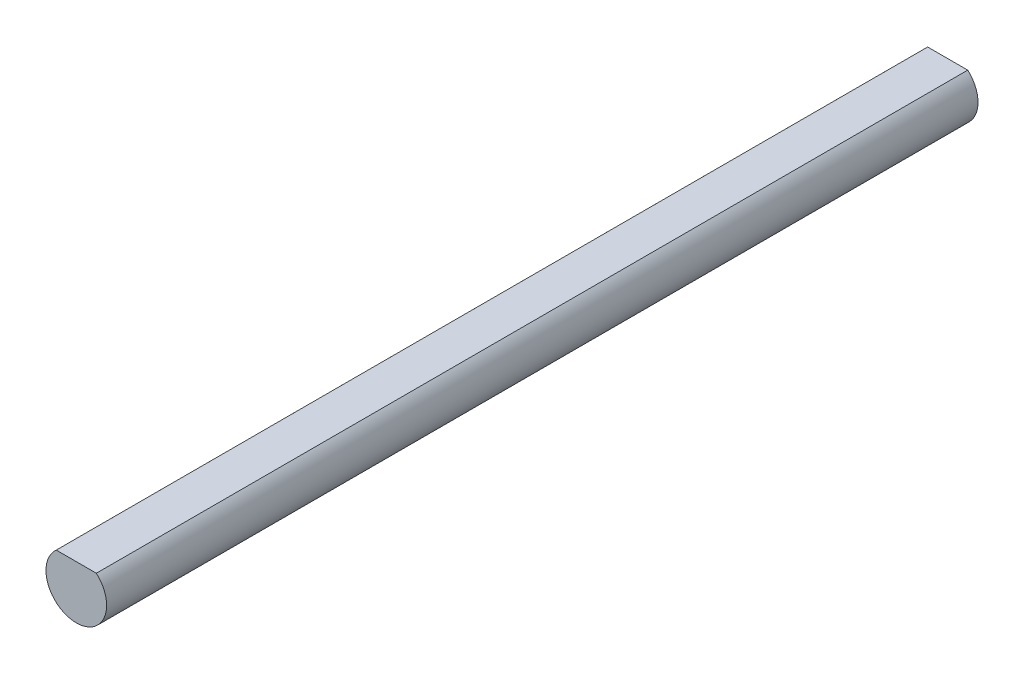
ISO-10303-21;
HEADER;
FILE_DESCRIPTION(('STEP AP214'),'2;1');
FILE_NAME('part.step','',(''),(''),'','','');
FILE_SCHEMA(('AUTOMOTIVE_DESIGN { 1 0 10303 214 1 1 1 1 }'));
ENDSEC;
DATA;
#1=APPLICATION_CONTEXT('core data for automotive mechanical design processes');
#2=APPLICATION_PROTOCOL_DEFINITION('international standard','automotive_design',2000,#1);
#3=PRODUCT_CONTEXT('',#1,'mechanical');
#4=PRODUCT('Part','Part','',(#3));
#5=PRODUCT_RELATED_PRODUCT_CATEGORY('part','',(#4));
#6=PRODUCT_DEFINITION_FORMATION('','',#4);
#7=PRODUCT_DEFINITION_CONTEXT('part definition',#1,'design');
#8=PRODUCT_DEFINITION('design','',#6,#7);
#9=PRODUCT_DEFINITION_SHAPE('','',#8);
#10=(LENGTH_UNIT() NAMED_UNIT(*) SI_UNIT(.MILLI.,.METRE.));
#11=(NAMED_UNIT(*) PLANE_ANGLE_UNIT() SI_UNIT($,.RADIAN.));
#12=(NAMED_UNIT(*) SI_UNIT($,.STERADIAN.) SOLID_ANGLE_UNIT());
#13=UNCERTAINTY_MEASURE_WITH_UNIT(LENGTH_MEASURE(1.E-05),#10,'distance_accuracy_value','');
#14=(GEOMETRIC_REPRESENTATION_CONTEXT(3) GLOBAL_UNCERTAINTY_ASSIGNED_CONTEXT((#13)) GLOBAL_UNIT_ASSIGNED_CONTEXT((#10,
#11,#12)) REPRESENTATION_CONTEXT('',''));
#15=CARTESIAN_POINT('',(0.,0.,0.));
#16=DIRECTION('',(0.,0.,1.));
#17=DIRECTION('',(1.,0.,0.));
#18=AXIS2_PLACEMENT_3D('',#15,#16,#17);
#19=CARTESIAN_POINT('',(0.,0.,115.));
#20=DIRECTION('',(0.,0.,-1.));
#21=DIRECTION('',(-1.,0.,0.));
#22=AXIS2_PLACEMENT_3D('',#19,#20,#21);
#23=CYLINDRICAL_SURFACE('',#22,4.);
#24=CARTESIAN_POINT('',(0.,0.,115.));
#25=DIRECTION('',(0.,0.,1.));
#26=DIRECTION('',(1.,0.,0.));
#27=AXIS2_PLACEMENT_3D('',#24,#25,#26);
#28=CIRCLE('',#27,4.);
#29=CARTESIAN_POINT('',(-2.64575131106459,3.,115.));
#30=VERTEX_POINT('',#29);
#31=CARTESIAN_POINT('',(2.64575131106459,3.,115.));
#32=VERTEX_POINT('',#31);
#33=EDGE_CURVE('E11',#30,#32,#28,.T.);
#34=ORIENTED_EDGE('',*,*,#33,.F.);
#35=DIRECTION('',(0.,0.,1.));
#36=VECTOR('',#35,1.);
#37=CARTESIAN_POINT('',(-2.64575131106459,3.,-0.001000000000001));
#38=LINE('',#37,#36);
#39=CARTESIAN_POINT('',(-2.64575131106459,3.,0.));
#40=VERTEX_POINT('',#39);
#41=EDGE_CURVE('E65',#40,#30,#38,.T.);
#42=ORIENTED_EDGE('',*,*,#41,.F.);
#43=CARTESIAN_POINT('',(0.,0.,0.));
#44=DIRECTION('',(0.,0.,1.));
#45=DIRECTION('',(1.,0.,0.));
#46=AXIS2_PLACEMENT_3D('',#43,#44,#45);
#47=CIRCLE('',#46,4.);
#48=CARTESIAN_POINT('',(2.64575131106459,3.,0.));
#49=VERTEX_POINT('',#48);
#50=EDGE_CURVE('E42',#40,#49,#47,.T.);
#51=ORIENTED_EDGE('',*,*,#50,.T.);
#52=DIRECTION('',(0.,0.,1.));
#53=VECTOR('',#52,1.);
#54=CARTESIAN_POINT('',(2.64575131106459,3.,-0.001000000000001));
#55=LINE('',#54,#53);
#56=EDGE_CURVE('E53',#49,#32,#55,.T.);
#57=ORIENTED_EDGE('',*,*,#56,.T.);
#58=EDGE_LOOP('',(#34,#42,#51,#57));
#59=FACE_BOUND('',#58,.T.);
#60=ADVANCED_FACE('F39',(#59),#23,.T.);
#61=CARTESIAN_POINT('',(0.,0.,115.));
#62=DIRECTION('',(0.,0.,1.));
#63=DIRECTION('',(1.,0.,0.));
#64=AXIS2_PLACEMENT_3D('',#61,#62,#63);
#65=PLANE('',#64);
#66=DIRECTION('',(1.,0.,0.));
#67=VECTOR('',#66,1.);
#68=CARTESIAN_POINT('',(-2.64575131106459,3.,115.));
#69=LINE('',#68,#67);
#70=EDGE_CURVE('E58',#30,#32,#69,.T.);
#71=ORIENTED_EDGE('',*,*,#70,.F.);
#72=ORIENTED_EDGE('',*,*,#33,.T.);
#73=EDGE_LOOP('',(#71,#72));
#74=FACE_BOUND('',#73,.T.);
#75=ADVANCED_FACE('F75',(#74),#65,.T.);
#76=CARTESIAN_POINT('',(0.,0.,0.));
#77=DIRECTION('',(0.,0.,1.));
#78=DIRECTION('',(1.,0.,0.));
#79=AXIS2_PLACEMENT_3D('',#76,#77,#78);
#80=PLANE('',#79);
#81=ORIENTED_EDGE('',*,*,#50,.F.);
#82=DIRECTION('',(-1.,0.,0.));
#83=VECTOR('',#82,1.);
#84=CARTESIAN_POINT('',(-2.64575131106459,3.,0.));
#85=LINE('',#84,#83);
#86=EDGE_CURVE('E62',#49,#40,#85,.T.);
#87=ORIENTED_EDGE('',*,*,#86,.F.);
#88=EDGE_LOOP('',(#81,#87));
#89=FACE_BOUND('',#88,.T.);
#90=ADVANCED_FACE('F73',(#89),#80,.F.);
#91=CARTESIAN_POINT('',(-2.64575131106459,3.,-0.001000000000001));
#92=DIRECTION('',(0.,-1.,0.));
#93=DIRECTION('',(0.,0.,-1.));
#94=AXIS2_PLACEMENT_3D('',#91,#92,#93);
#95=PLANE('',#94);
#96=ORIENTED_EDGE('',*,*,#86,.T.);
#97=ORIENTED_EDGE('',*,*,#41,.T.);
#98=ORIENTED_EDGE('',*,*,#70,.T.);
#99=ORIENTED_EDGE('',*,*,#56,.F.);
#100=EDGE_LOOP('',(#96,#97,#98,#99));
#101=FACE_BOUND('',#100,.T.);
#102=ADVANCED_FACE('F64',(#101),#95,.F.);
#103=CLOSED_SHELL('',(#60,#75,#90,#102));
#104=MANIFOLD_SOLID_BREP('B2',#103);
#105=ADVANCED_BREP_SHAPE_REPRESENTATION('',(#18,#104),#14);
#106=SHAPE_DEFINITION_REPRESENTATION(#9,#105);
ENDSEC;
END-ISO-10303-21;
